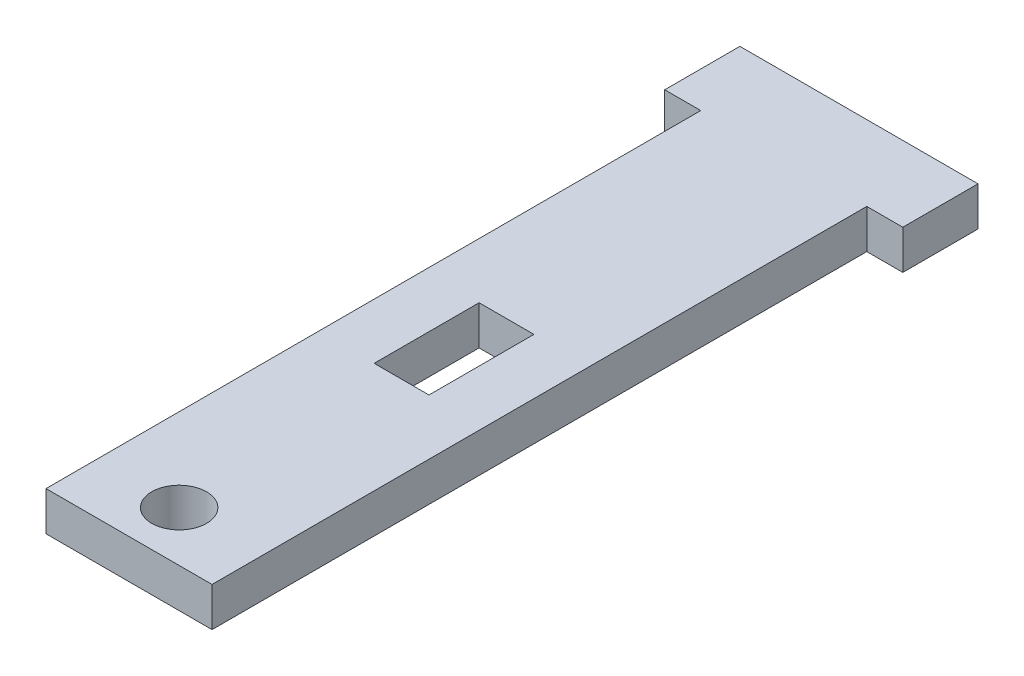
ISO-10303-21;
HEADER;
FILE_DESCRIPTION(('STEP AP214'),'2;1');
FILE_NAME('part.step','',(''),(''),'','','');
FILE_SCHEMA(('AUTOMOTIVE_DESIGN { 1 0 10303 214 1 1 1 1 }'));
ENDSEC;
DATA;
#1=APPLICATION_CONTEXT('core data for automotive mechanical design processes');
#2=APPLICATION_PROTOCOL_DEFINITION('international standard','automotive_design',2000,#1);
#3=PRODUCT_CONTEXT('',#1,'mechanical');
#4=PRODUCT('Part','Part','',(#3));
#5=PRODUCT_RELATED_PRODUCT_CATEGORY('part','',(#4));
#6=PRODUCT_DEFINITION_FORMATION('','',#4);
#7=PRODUCT_DEFINITION_CONTEXT('part definition',#1,'design');
#8=PRODUCT_DEFINITION('design','',#6,#7);
#9=PRODUCT_DEFINITION_SHAPE('','',#8);
#10=(LENGTH_UNIT() NAMED_UNIT(*) SI_UNIT(.MILLI.,.METRE.));
#11=(NAMED_UNIT(*) PLANE_ANGLE_UNIT() SI_UNIT($,.RADIAN.));
#12=(NAMED_UNIT(*) SI_UNIT($,.STERADIAN.) SOLID_ANGLE_UNIT());
#13=UNCERTAINTY_MEASURE_WITH_UNIT(LENGTH_MEASURE(1.E-05),#10,'distance_accuracy_value','');
#14=(GEOMETRIC_REPRESENTATION_CONTEXT(3) GLOBAL_UNCERTAINTY_ASSIGNED_CONTEXT((#13)) GLOBAL_UNIT_ASSIGNED_CONTEXT((#10,
#11,#12)) REPRESENTATION_CONTEXT('',''));
#15=CARTESIAN_POINT('',(0.,0.,0.));
#16=DIRECTION('',(0.,0.,1.));
#17=DIRECTION('',(1.,0.,0.));
#18=AXIS2_PLACEMENT_3D('',#15,#16,#17);
#19=CARTESIAN_POINT('',(0.,2.5,0.));
#20=DIRECTION('',(0.,-1.,0.));
#21=DIRECTION('',(0.,0.,-1.));
#22=AXIS2_PLACEMENT_3D('',#19,#20,#21);
#23=PLANE('',#22);
#24=CARTESIAN_POINT('',(0.,2.5,-3.2));
#25=DIRECTION('',(0.,1.,0.));
#26=DIRECTION('',(0.,0.,1.));
#27=AXIS2_PLACEMENT_3D('',#24,#25,#26);
#28=CIRCLE('',#27,1.75);
#29=CARTESIAN_POINT('',(0.,2.5,-1.45));
#30=VERTEX_POINT('',#29);
#31=EDGE_CURVE('E158',#30,#30,#28,.T.);
#32=ORIENTED_EDGE('',*,*,#31,.F.);
#33=EDGE_LOOP('',(#32));
#34=FACE_BOUND('',#33,.T.);
#35=DIRECTION('',(0.,0.,-1.));
#36=VECTOR('',#35,1.);
#37=CARTESIAN_POINT('',(7.6,2.5,-41.8));
#38=LINE('',#37,#36);
#39=CARTESIAN_POINT('',(7.6,2.5,-41.8));
#40=VERTEX_POINT('',#39);
#41=CARTESIAN_POINT('',(7.6,2.5,-46.6));
#42=VERTEX_POINT('',#41);
#43=EDGE_CURVE('E164',#40,#42,#38,.T.);
#44=ORIENTED_EDGE('',*,*,#43,.T.);
#45=DIRECTION('',(-1.,0.,0.));
#46=VECTOR('',#45,1.);
#47=CARTESIAN_POINT('',(-7.6,2.5,-46.6));
#48=LINE('',#47,#46);
#49=CARTESIAN_POINT('',(-7.6,2.5,-46.6));
#50=VERTEX_POINT('',#49);
#51=EDGE_CURVE('E167',#42,#50,#48,.T.);
#52=ORIENTED_EDGE('',*,*,#51,.T.);
#53=DIRECTION('',(0.,0.,1.));
#54=VECTOR('',#53,1.);
#55=CARTESIAN_POINT('',(-7.6,2.5,-41.8));
#56=LINE('',#55,#54);
#57=CARTESIAN_POINT('',(-7.6,2.5,-41.8));
#58=VERTEX_POINT('',#57);
#59=EDGE_CURVE('E170',#50,#58,#56,.T.);
#60=ORIENTED_EDGE('',*,*,#59,.T.);
#61=DIRECTION('',(1.,0.,0.));
#62=VECTOR('',#61,1.);
#63=CARTESIAN_POINT('',(-5.3,2.5,-41.8));
#64=LINE('',#63,#62);
#65=CARTESIAN_POINT('',(-5.3,2.5,-41.8));
#66=VERTEX_POINT('',#65);
#67=EDGE_CURVE('E172',#58,#66,#64,.T.);
#68=ORIENTED_EDGE('',*,*,#67,.T.);
#69=DIRECTION('',(0.,0.,1.));
#70=VECTOR('',#69,1.);
#71=CARTESIAN_POINT('',(-5.3,2.5,0.));
#72=LINE('',#71,#70);
#73=CARTESIAN_POINT('',(-5.3,2.5,0.));
#74=VERTEX_POINT('',#73);
#75=EDGE_CURVE('E174',#66,#74,#72,.T.);
#76=ORIENTED_EDGE('',*,*,#75,.T.);
#77=DIRECTION('',(1.,0.,0.));
#78=VECTOR('',#77,1.);
#79=CARTESIAN_POINT('',(5.3,2.5,0.));
#80=LINE('',#79,#78);
#81=CARTESIAN_POINT('',(5.3,2.5,0.));
#82=VERTEX_POINT('',#81);
#83=EDGE_CURVE('E176',#74,#82,#80,.T.);
#84=ORIENTED_EDGE('',*,*,#83,.T.);
#85=DIRECTION('',(0.,0.,-1.));
#86=VECTOR('',#85,1.);
#87=CARTESIAN_POINT('',(5.3,2.5,0.));
#88=LINE('',#87,#86);
#89=CARTESIAN_POINT('',(5.3,2.5,-41.8));
#90=VERTEX_POINT('',#89);
#91=EDGE_CURVE('E178',#82,#90,#88,.T.);
#92=ORIENTED_EDGE('',*,*,#91,.T.);
#93=DIRECTION('',(1.,0.,0.));
#94=VECTOR('',#93,1.);
#95=CARTESIAN_POINT('',(5.3,2.5,-41.8));
#96=LINE('',#95,#94);
#97=EDGE_CURVE('E180',#90,#40,#96,.T.);
#98=ORIENTED_EDGE('',*,*,#97,.T.);
#99=EDGE_LOOP('',(#44,#52,#60,#68,#76,#84,#92,#98));
#100=FACE_BOUND('',#99,.T.);
#101=DIRECTION('',(0.,0.,-1.));
#102=VECTOR('',#101,1.);
#103=CARTESIAN_POINT('',(1.74999999999999,2.5,-24.1));
#104=LINE('',#103,#102);
#105=CARTESIAN_POINT('',(1.74999999999999,2.5,-17.4));
#106=VERTEX_POINT('',#105);
#107=CARTESIAN_POINT('',(1.74999999999999,2.5,-24.1));
#108=VERTEX_POINT('',#107);
#109=EDGE_CURVE('E122',#106,#108,#104,.T.);
#110=ORIENTED_EDGE('',*,*,#109,.F.);
#111=DIRECTION('',(1.,0.,0.));
#112=VECTOR('',#111,1.);
#113=CARTESIAN_POINT('',(-1.75000000000001,2.5,-17.4));
#114=LINE('',#113,#112);
#115=CARTESIAN_POINT('',(-1.75000000000001,2.5,-17.4));
#116=VERTEX_POINT('',#115);
#117=EDGE_CURVE('E144',#116,#106,#114,.T.);
#118=ORIENTED_EDGE('',*,*,#117,.F.);
#119=DIRECTION('',(0.,0.,1.));
#120=VECTOR('',#119,1.);
#121=CARTESIAN_POINT('',(-1.75000000000001,2.5,-24.1));
#122=LINE('',#121,#120);
#123=CARTESIAN_POINT('',(-1.75000000000001,2.5,-24.1));
#124=VERTEX_POINT('',#123);
#125=EDGE_CURVE('E142',#124,#116,#122,.T.);
#126=ORIENTED_EDGE('',*,*,#125,.F.);
#127=DIRECTION('',(-1.,0.,0.));
#128=VECTOR('',#127,1.);
#129=CARTESIAN_POINT('',(-1.75000000000001,2.5,-24.1));
#130=LINE('',#129,#128);
#131=EDGE_CURVE('E130',#108,#124,#130,.T.);
#132=ORIENTED_EDGE('',*,*,#131,.F.);
#133=EDGE_LOOP('',(#110,#118,#126,#132));
#134=FACE_BOUND('',#133,.T.);
#135=ADVANCED_FACE('F33',(#34,#100,#134),#23,.F.);
#136=CARTESIAN_POINT('',(0.,0.,0.));
#137=DIRECTION('',(0.,-1.,0.));
#138=DIRECTION('',(0.,0.,-1.));
#139=AXIS2_PLACEMENT_3D('',#136,#137,#138);
#140=PLANE('',#139);
#141=CARTESIAN_POINT('',(0.,0.,-3.2));
#142=DIRECTION('',(0.,1.,0.));
#143=DIRECTION('',(0.,0.,1.));
#144=AXIS2_PLACEMENT_3D('',#141,#142,#143);
#145=CIRCLE('',#144,1.75);
#146=CARTESIAN_POINT('',(0.,0.,-1.45));
#147=VERTEX_POINT('',#146);
#148=EDGE_CURVE('E138',#147,#147,#145,.T.);
#149=ORIENTED_EDGE('',*,*,#148,.T.);
#150=EDGE_LOOP('',(#149));
#151=FACE_BOUND('',#150,.T.);
#152=DIRECTION('',(0.,0.,-1.));
#153=VECTOR('',#152,1.);
#154=CARTESIAN_POINT('',(7.6,0.,-41.8));
#155=LINE('',#154,#153);
#156=CARTESIAN_POINT('',(7.6,0.,-41.8));
#157=VERTEX_POINT('',#156);
#158=CARTESIAN_POINT('',(7.6,0.,-46.6));
#159=VERTEX_POINT('',#158);
#160=EDGE_CURVE('E161',#157,#159,#155,.T.);
#161=ORIENTED_EDGE('',*,*,#160,.F.);
#162=DIRECTION('',(1.,0.,0.));
#163=VECTOR('',#162,1.);
#164=CARTESIAN_POINT('',(5.3,0.,-41.8));
#165=LINE('',#164,#163);
#166=CARTESIAN_POINT('',(5.3,0.,-41.8));
#167=VERTEX_POINT('',#166);
#168=EDGE_CURVE('E168',#167,#157,#165,.T.);
#169=ORIENTED_EDGE('',*,*,#168,.F.);
#170=DIRECTION('',(0.,0.,-1.));
#171=VECTOR('',#170,1.);
#172=CARTESIAN_POINT('',(5.3,0.,0.));
#173=LINE('',#172,#171);
#174=CARTESIAN_POINT('',(5.3,0.,0.));
#175=VERTEX_POINT('',#174);
#176=EDGE_CURVE('E195',#175,#167,#173,.T.);
#177=ORIENTED_EDGE('',*,*,#176,.F.);
#178=DIRECTION('',(1.,0.,0.));
#179=VECTOR('',#178,1.);
#180=CARTESIAN_POINT('',(5.3,0.,0.));
#181=LINE('',#180,#179);
#182=CARTESIAN_POINT('',(-5.3,0.,0.));
#183=VERTEX_POINT('',#182);
#184=EDGE_CURVE('E193',#183,#175,#181,.T.);
#185=ORIENTED_EDGE('',*,*,#184,.F.);
#186=DIRECTION('',(0.,0.,1.));
#187=VECTOR('',#186,1.);
#188=CARTESIAN_POINT('',(-5.3,0.,0.));
#189=LINE('',#188,#187);
#190=CARTESIAN_POINT('',(-5.3,0.,-41.8));
#191=VERTEX_POINT('',#190);
#192=EDGE_CURVE('E191',#191,#183,#189,.T.);
#193=ORIENTED_EDGE('',*,*,#192,.F.);
#194=DIRECTION('',(1.,0.,0.));
#195=VECTOR('',#194,1.);
#196=CARTESIAN_POINT('',(-5.3,0.,-41.8));
#197=LINE('',#196,#195);
#198=CARTESIAN_POINT('',(-7.6,0.,-41.8));
#199=VERTEX_POINT('',#198);
#200=EDGE_CURVE('E189',#199,#191,#197,.T.);
#201=ORIENTED_EDGE('',*,*,#200,.F.);
#202=DIRECTION('',(0.,0.,1.));
#203=VECTOR('',#202,1.);
#204=CARTESIAN_POINT('',(-7.6,0.,-41.8));
#205=LINE('',#204,#203);
#206=CARTESIAN_POINT('',(-7.6,0.,-46.6));
#207=VERTEX_POINT('',#206);
#208=EDGE_CURVE('E187',#207,#199,#205,.T.);
#209=ORIENTED_EDGE('',*,*,#208,.F.);
#210=DIRECTION('',(-1.,0.,0.));
#211=VECTOR('',#210,1.);
#212=CARTESIAN_POINT('',(-7.6,0.,-46.6));
#213=LINE('',#212,#211);
#214=EDGE_CURVE('E185',#159,#207,#213,.T.);
#215=ORIENTED_EDGE('',*,*,#214,.F.);
#216=EDGE_LOOP('',(#161,#169,#177,#185,#193,#201,#209,#215));
#217=FACE_BOUND('',#216,.T.);
#218=DIRECTION('',(1.,0.,0.));
#219=VECTOR('',#218,1.);
#220=CARTESIAN_POINT('',(-1.75000000000001,0.,-17.4));
#221=LINE('',#220,#219);
#222=CARTESIAN_POINT('',(-1.75000000000001,0.,-17.4));
#223=VERTEX_POINT('',#222);
#224=CARTESIAN_POINT('',(1.74999999999999,0.,-17.4));
#225=VERTEX_POINT('',#224);
#226=EDGE_CURVE('E131',#223,#225,#221,.T.);
#227=ORIENTED_EDGE('',*,*,#226,.T.);
#228=DIRECTION('',(0.,0.,-1.));
#229=VECTOR('',#228,1.);
#230=CARTESIAN_POINT('',(1.74999999999999,0.,-24.1));
#231=LINE('',#230,#229);
#232=CARTESIAN_POINT('',(1.74999999999999,0.,-24.1));
#233=VERTEX_POINT('',#232);
#234=EDGE_CURVE('E56',#225,#233,#231,.T.);
#235=ORIENTED_EDGE('',*,*,#234,.T.);
#236=DIRECTION('',(-1.,0.,0.));
#237=VECTOR('',#236,1.);
#238=CARTESIAN_POINT('',(-1.75000000000001,0.,-24.1));
#239=LINE('',#238,#237);
#240=CARTESIAN_POINT('',(-1.75000000000001,0.,-24.1));
#241=VERTEX_POINT('',#240);
#242=EDGE_CURVE('E137',#233,#241,#239,.T.);
#243=ORIENTED_EDGE('',*,*,#242,.T.);
#244=DIRECTION('',(0.,0.,1.));
#245=VECTOR('',#244,1.);
#246=CARTESIAN_POINT('',(-1.75000000000001,0.,-24.1));
#247=LINE('',#246,#245);
#248=EDGE_CURVE('E150',#241,#223,#247,.T.);
#249=ORIENTED_EDGE('',*,*,#248,.T.);
#250=EDGE_LOOP('',(#227,#235,#243,#249));
#251=FACE_BOUND('',#250,.T.);
#252=ADVANCED_FACE('F225',(#151,#217,#251),#140,.T.);
#253=CARTESIAN_POINT('',(7.6,2.5,-41.8));
#254=DIRECTION('',(-1.,0.,0.));
#255=DIRECTION('',(0.,0.,1.));
#256=AXIS2_PLACEMENT_3D('',#253,#254,#255);
#257=PLANE('',#256);
#258=ORIENTED_EDGE('',*,*,#160,.T.);
#259=DIRECTION('',(0.,-1.,0.));
#260=VECTOR('',#259,1.);
#261=CARTESIAN_POINT('',(7.6,2.5,-46.6));
#262=LINE('',#261,#260);
#263=EDGE_CURVE('E11',#42,#159,#262,.T.);
#264=ORIENTED_EDGE('',*,*,#263,.F.);
#265=ORIENTED_EDGE('',*,*,#43,.F.);
#266=DIRECTION('',(0.,-1.,0.));
#267=VECTOR('',#266,1.);
#268=CARTESIAN_POINT('',(7.6,2.5,-41.8));
#269=LINE('',#268,#267);
#270=EDGE_CURVE('E182',#40,#157,#269,.T.);
#271=ORIENTED_EDGE('',*,*,#270,.T.);
#272=EDGE_LOOP('',(#258,#264,#265,#271));
#273=FACE_BOUND('',#272,.T.);
#274=ADVANCED_FACE('F35',(#273),#257,.F.);
#275=CARTESIAN_POINT('',(-7.6,2.5,-46.6));
#276=DIRECTION('',(0.,0.,1.));
#277=DIRECTION('',(1.,0.,0.));
#278=AXIS2_PLACEMENT_3D('',#275,#276,#277);
#279=PLANE('',#278);
#280=ORIENTED_EDGE('',*,*,#214,.T.);
#281=DIRECTION('',(0.,-1.,0.));
#282=VECTOR('',#281,1.);
#283=CARTESIAN_POINT('',(-7.6,2.5,-46.6));
#284=LINE('',#283,#282);
#285=EDGE_CURVE('E41',#50,#207,#284,.T.);
#286=ORIENTED_EDGE('',*,*,#285,.F.);
#287=ORIENTED_EDGE('',*,*,#51,.F.);
#288=ORIENTED_EDGE('',*,*,#263,.T.);
#289=EDGE_LOOP('',(#280,#286,#287,#288));
#290=FACE_BOUND('',#289,.T.);
#291=ADVANCED_FACE('F242',(#290),#279,.F.);
#292=CARTESIAN_POINT('',(-7.6,2.5,-41.8));
#293=DIRECTION('',(1.,0.,0.));
#294=DIRECTION('',(0.,0.,-1.));
#295=AXIS2_PLACEMENT_3D('',#292,#293,#294);
#296=PLANE('',#295);
#297=ORIENTED_EDGE('',*,*,#208,.T.);
#298=DIRECTION('',(0.,-1.,0.));
#299=VECTOR('',#298,1.);
#300=CARTESIAN_POINT('',(-7.6,2.5,-41.8));
#301=LINE('',#300,#299);
#302=EDGE_CURVE('E212',#58,#199,#301,.T.);
#303=ORIENTED_EDGE('',*,*,#302,.F.);
#304=ORIENTED_EDGE('',*,*,#59,.F.);
#305=ORIENTED_EDGE('',*,*,#285,.T.);
#306=EDGE_LOOP('',(#297,#303,#304,#305));
#307=FACE_BOUND('',#306,.T.);
#308=ADVANCED_FACE('F219',(#307),#296,.F.);
#309=CARTESIAN_POINT('',(-5.3,2.5,-41.8));
#310=DIRECTION('',(0.,0.,-1.));
#311=DIRECTION('',(-1.,0.,0.));
#312=AXIS2_PLACEMENT_3D('',#309,#310,#311);
#313=PLANE('',#312);
#314=ORIENTED_EDGE('',*,*,#200,.T.);
#315=DIRECTION('',(0.,-1.,0.));
#316=VECTOR('',#315,1.);
#317=CARTESIAN_POINT('',(-5.3,2.5,-41.8));
#318=LINE('',#317,#316);
#319=EDGE_CURVE('E209',#66,#191,#318,.T.);
#320=ORIENTED_EDGE('',*,*,#319,.F.);
#321=ORIENTED_EDGE('',*,*,#67,.F.);
#322=ORIENTED_EDGE('',*,*,#302,.T.);
#323=EDGE_LOOP('',(#314,#320,#321,#322));
#324=FACE_BOUND('',#323,.T.);
#325=ADVANCED_FACE('F231',(#324),#313,.F.);
#326=CARTESIAN_POINT('',(-5.3,2.5,0.));
#327=DIRECTION('',(1.,0.,0.));
#328=DIRECTION('',(0.,0.,-1.));
#329=AXIS2_PLACEMENT_3D('',#326,#327,#328);
#330=PLANE('',#329);
#331=ORIENTED_EDGE('',*,*,#192,.T.);
#332=DIRECTION('',(0.,-1.,0.));
#333=VECTOR('',#332,1.);
#334=CARTESIAN_POINT('',(-5.3,2.5,0.));
#335=LINE('',#334,#333);
#336=EDGE_CURVE('E206',#74,#183,#335,.T.);
#337=ORIENTED_EDGE('',*,*,#336,.F.);
#338=ORIENTED_EDGE('',*,*,#75,.F.);
#339=ORIENTED_EDGE('',*,*,#319,.T.);
#340=EDGE_LOOP('',(#331,#337,#338,#339));
#341=FACE_BOUND('',#340,.T.);
#342=ADVANCED_FACE('F235',(#341),#330,.F.);
#343=CARTESIAN_POINT('',(5.3,2.5,0.));
#344=DIRECTION('',(0.,0.,-1.));
#345=DIRECTION('',(-1.,0.,0.));
#346=AXIS2_PLACEMENT_3D('',#343,#344,#345);
#347=PLANE('',#346);
#348=ORIENTED_EDGE('',*,*,#184,.T.);
#349=DIRECTION('',(0.,-1.,0.));
#350=VECTOR('',#349,1.);
#351=CARTESIAN_POINT('',(5.3,2.5,0.));
#352=LINE('',#351,#350);
#353=EDGE_CURVE('E203',#82,#175,#352,.T.);
#354=ORIENTED_EDGE('',*,*,#353,.F.);
#355=ORIENTED_EDGE('',*,*,#83,.F.);
#356=ORIENTED_EDGE('',*,*,#336,.T.);
#357=EDGE_LOOP('',(#348,#354,#355,#356));
#358=FACE_BOUND('',#357,.T.);
#359=ADVANCED_FACE('F255',(#358),#347,.F.);
#360=CARTESIAN_POINT('',(5.3,2.5,0.));
#361=DIRECTION('',(-1.,0.,0.));
#362=DIRECTION('',(0.,0.,1.));
#363=AXIS2_PLACEMENT_3D('',#360,#361,#362);
#364=PLANE('',#363);
#365=ORIENTED_EDGE('',*,*,#176,.T.);
#366=DIRECTION('',(0.,-1.,0.));
#367=VECTOR('',#366,1.);
#368=CARTESIAN_POINT('',(5.3,2.5,-41.8));
#369=LINE('',#368,#367);
#370=EDGE_CURVE('E200',#90,#167,#369,.T.);
#371=ORIENTED_EDGE('',*,*,#370,.F.);
#372=ORIENTED_EDGE('',*,*,#91,.F.);
#373=ORIENTED_EDGE('',*,*,#353,.T.);
#374=EDGE_LOOP('',(#365,#371,#372,#373));
#375=FACE_BOUND('',#374,.T.);
#376=ADVANCED_FACE('F253',(#375),#364,.F.);
#377=CARTESIAN_POINT('',(5.3,2.5,-41.8));
#378=DIRECTION('',(0.,0.,-1.));
#379=DIRECTION('',(-1.,0.,0.));
#380=AXIS2_PLACEMENT_3D('',#377,#378,#379);
#381=PLANE('',#380);
#382=ORIENTED_EDGE('',*,*,#168,.T.);
#383=ORIENTED_EDGE('',*,*,#270,.F.);
#384=ORIENTED_EDGE('',*,*,#97,.F.);
#385=ORIENTED_EDGE('',*,*,#370,.T.);
#386=EDGE_LOOP('',(#382,#383,#384,#385));
#387=FACE_BOUND('',#386,.T.);
#388=ADVANCED_FACE('F248',(#387),#381,.F.);
#389=CARTESIAN_POINT('',(0.,2.5,-3.2));
#390=DIRECTION('',(0.,-1.,0.));
#391=DIRECTION('',(0.,0.,-1.));
#392=AXIS2_PLACEMENT_3D('',#389,#390,#391);
#393=CYLINDRICAL_SURFACE('',#392,1.75);
#394=ORIENTED_EDGE('',*,*,#31,.T.);
#395=EDGE_LOOP('',(#394));
#396=FACE_BOUND('',#395,.T.);
#397=ORIENTED_EDGE('',*,*,#148,.F.);
#398=EDGE_LOOP('',(#397));
#399=FACE_BOUND('',#398,.T.);
#400=ADVANCED_FACE('F274',(#396,#399),#393,.F.);
#401=CARTESIAN_POINT('',(1.74999999999999,2.5,-24.1));
#402=DIRECTION('',(-1.,0.,0.));
#403=DIRECTION('',(0.,0.,1.));
#404=AXIS2_PLACEMENT_3D('',#401,#402,#403);
#405=PLANE('',#404);
#406=ORIENTED_EDGE('',*,*,#234,.F.);
#407=DIRECTION('',(0.,-1.,0.));
#408=VECTOR('',#407,1.);
#409=CARTESIAN_POINT('',(1.74999999999999,2.5,-17.4));
#410=LINE('',#409,#408);
#411=EDGE_CURVE('E126',#106,#225,#410,.T.);
#412=ORIENTED_EDGE('',*,*,#411,.F.);
#413=ORIENTED_EDGE('',*,*,#109,.T.);
#414=DIRECTION('',(0.,-1.,0.));
#415=VECTOR('',#414,1.);
#416=CARTESIAN_POINT('',(1.74999999999999,2.5,-24.1));
#417=LINE('',#416,#415);
#418=EDGE_CURVE('E125',#108,#233,#417,.T.);
#419=ORIENTED_EDGE('',*,*,#418,.T.);
#420=EDGE_LOOP('',(#406,#412,#413,#419));
#421=FACE_BOUND('',#420,.T.);
#422=ADVANCED_FACE('F124',(#421),#405,.T.);
#423=CARTESIAN_POINT('',(-1.75000000000001,2.5,-24.1));
#424=DIRECTION('',(0.,0.,1.));
#425=DIRECTION('',(1.,0.,0.));
#426=AXIS2_PLACEMENT_3D('',#423,#424,#425);
#427=PLANE('',#426);
#428=ORIENTED_EDGE('',*,*,#242,.F.);
#429=ORIENTED_EDGE('',*,*,#418,.F.);
#430=ORIENTED_EDGE('',*,*,#131,.T.);
#431=DIRECTION('',(0.,-1.,0.));
#432=VECTOR('',#431,1.);
#433=CARTESIAN_POINT('',(-1.75000000000001,2.5,-24.1));
#434=LINE('',#433,#432);
#435=EDGE_CURVE('E139',#124,#241,#434,.T.);
#436=ORIENTED_EDGE('',*,*,#435,.T.);
#437=EDGE_LOOP('',(#428,#429,#430,#436));
#438=FACE_BOUND('',#437,.T.);
#439=ADVANCED_FACE('F134',(#438),#427,.T.);
#440=CARTESIAN_POINT('',(-1.75000000000001,2.5,-24.1));
#441=DIRECTION('',(1.,0.,0.));
#442=DIRECTION('',(0.,0.,-1.));
#443=AXIS2_PLACEMENT_3D('',#440,#441,#442);
#444=PLANE('',#443);
#445=ORIENTED_EDGE('',*,*,#248,.F.);
#446=ORIENTED_EDGE('',*,*,#435,.F.);
#447=ORIENTED_EDGE('',*,*,#125,.T.);
#448=DIRECTION('',(0.,-1.,0.));
#449=VECTOR('',#448,1.);
#450=CARTESIAN_POINT('',(-1.75000000000001,2.5,-17.4));
#451=LINE('',#450,#449);
#452=EDGE_CURVE('E48',#116,#223,#451,.T.);
#453=ORIENTED_EDGE('',*,*,#452,.T.);
#454=EDGE_LOOP('',(#445,#446,#447,#453));
#455=FACE_BOUND('',#454,.T.);
#456=ADVANCED_FACE('F290',(#455),#444,.T.);
#457=CARTESIAN_POINT('',(-1.75000000000001,2.5,-17.4));
#458=DIRECTION('',(0.,0.,-1.));
#459=DIRECTION('',(-1.,0.,0.));
#460=AXIS2_PLACEMENT_3D('',#457,#458,#459);
#461=PLANE('',#460);
#462=ORIENTED_EDGE('',*,*,#226,.F.);
#463=ORIENTED_EDGE('',*,*,#452,.F.);
#464=ORIENTED_EDGE('',*,*,#117,.T.);
#465=ORIENTED_EDGE('',*,*,#411,.T.);
#466=EDGE_LOOP('',(#462,#463,#464,#465));
#467=FACE_BOUND('',#466,.T.);
#468=ADVANCED_FACE('F295',(#467),#461,.T.);
#469=CLOSED_SHELL('',(#135,#252,#274,#291,#308,#325,#342,#359,#376,#388,#400,#422,#439,#456,#468));
#470=MANIFOLD_SOLID_BREP('B2',#469);
#471=ADVANCED_BREP_SHAPE_REPRESENTATION('',(#18,#470),#14);
#472=SHAPE_DEFINITION_REPRESENTATION(#9,#471);
ENDSEC;
END-ISO-10303-21;
